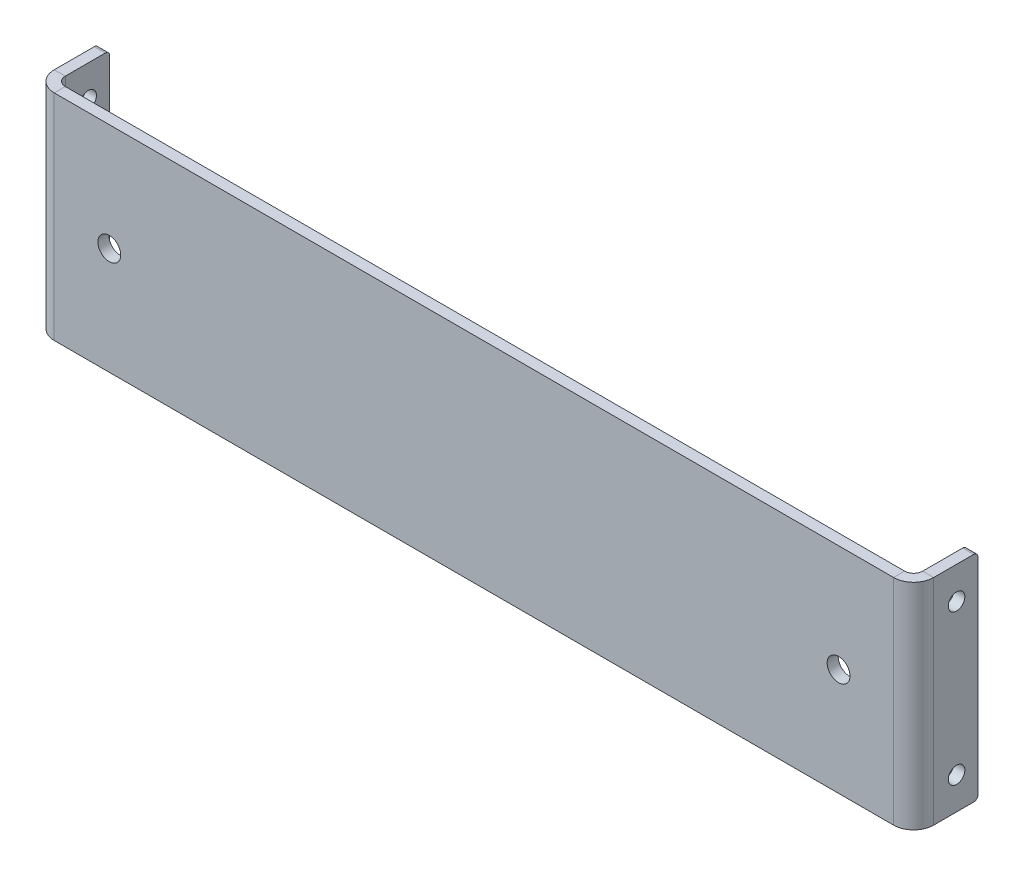
ISO-10303-21;
HEADER;
FILE_DESCRIPTION(('STEP AP214'),'2;1');
FILE_NAME('part.step','',(''),(''),'','','');
FILE_SCHEMA(('AUTOMOTIVE_DESIGN { 1 0 10303 214 1 1 1 1 }'));
ENDSEC;
DATA;
#1=APPLICATION_CONTEXT('core data for automotive mechanical design processes');
#2=APPLICATION_PROTOCOL_DEFINITION('international standard','automotive_design',2000,#1);
#3=PRODUCT_CONTEXT('',#1,'mechanical');
#4=PRODUCT('Part','Part','',(#3));
#5=PRODUCT_RELATED_PRODUCT_CATEGORY('part','',(#4));
#6=PRODUCT_DEFINITION_FORMATION('','',#4);
#7=PRODUCT_DEFINITION_CONTEXT('part definition',#1,'design');
#8=PRODUCT_DEFINITION('design','',#6,#7);
#9=PRODUCT_DEFINITION_SHAPE('','',#8);
#10=(LENGTH_UNIT() NAMED_UNIT(*) SI_UNIT(.MILLI.,.METRE.));
#11=(NAMED_UNIT(*) PLANE_ANGLE_UNIT() SI_UNIT($,.RADIAN.));
#12=(NAMED_UNIT(*) SI_UNIT($,.STERADIAN.) SOLID_ANGLE_UNIT());
#13=UNCERTAINTY_MEASURE_WITH_UNIT(LENGTH_MEASURE(1.E-05),#10,'distance_accuracy_value','');
#14=(GEOMETRIC_REPRESENTATION_CONTEXT(3) GLOBAL_UNCERTAINTY_ASSIGNED_CONTEXT((#13)) GLOBAL_UNIT_ASSIGNED_CONTEXT((#10,
#11,#12)) REPRESENTATION_CONTEXT('',''));
#15=CARTESIAN_POINT('',(0.,0.,0.));
#16=DIRECTION('',(0.,0.,1.));
#17=DIRECTION('',(1.,0.,0.));
#18=AXIS2_PLACEMENT_3D('',#15,#16,#17);
#19=CARTESIAN_POINT('',(0.,0.,-3.2639));
#20=DIRECTION('',(0.,0.,-1.));
#21=DIRECTION('',(-1.,0.,0.));
#22=AXIS2_PLACEMENT_3D('',#19,#20,#21);
#23=PLANE('',#22);
#24=CARTESIAN_POINT('',(-107.95,0.,-3.2639));
#25=DIRECTION('',(0.,0.,-1.));
#26=DIRECTION('',(-1.,0.,0.));
#27=AXIS2_PLACEMENT_3D('',#24,#25,#26);
#28=CIRCLE('',#27,3.3782);
#29=CARTESIAN_POINT('',(-111.3282,0.,-3.2639));
#30=VERTEX_POINT('',#29);
#31=EDGE_CURVE('E446',#30,#30,#28,.T.);
#32=ORIENTED_EDGE('',*,*,#31,.F.);
#33=EDGE_LOOP('',(#32));
#34=FACE_BOUND('',#33,.T.);
#35=CARTESIAN_POINT('',(107.95,0.,-3.2639));
#36=DIRECTION('',(0.,0.,-1.));
#37=DIRECTION('',(-1.,0.,0.));
#38=AXIS2_PLACEMENT_3D('',#35,#36,#37);
#39=CIRCLE('',#38,3.3782);
#40=CARTESIAN_POINT('',(104.5718,0.,-3.2639));
#41=VERTEX_POINT('',#40);
#42=EDGE_CURVE('E440',#41,#41,#39,.T.);
#43=ORIENTED_EDGE('',*,*,#42,.F.);
#44=EDGE_LOOP('',(#43));
#45=FACE_BOUND('',#44,.T.);
#46=DIRECTION('',(1.,0.,0.));
#47=VECTOR('',#46,1.);
#48=CARTESIAN_POINT('',(-130.175,-31.75,-3.2639));
#49=LINE('',#48,#47);
#50=CARTESIAN_POINT('',(-124.25426,-31.75,-3.26390000000002));
#51=VERTEX_POINT('',#50);
#52=CARTESIAN_POINT('',(124.25426,-31.75,-3.2639));
#53=VERTEX_POINT('',#52);
#54=EDGE_CURVE('E314',#51,#53,#49,.T.);
#55=ORIENTED_EDGE('',*,*,#54,.F.);
#56=DIRECTION('',(0.,1.,0.));
#57=VECTOR('',#56,1.);
#58=CARTESIAN_POINT('',(-124.25426,31.75,-3.26390000000002));
#59=LINE('',#58,#57);
#60=CARTESIAN_POINT('',(-124.25426,31.75,-3.26390000000002));
#61=VERTEX_POINT('',#60);
#62=EDGE_CURVE('E252',#61,#51,#59,.F.);
#63=ORIENTED_EDGE('',*,*,#62,.F.);
#64=DIRECTION('',(-1.,0.,0.));
#65=VECTOR('',#64,1.);
#66=CARTESIAN_POINT('',(-130.175,31.75,-3.2639));
#67=LINE('',#66,#65);
#68=CARTESIAN_POINT('',(124.25426,31.75,-3.2639));
#69=VERTEX_POINT('',#68);
#70=EDGE_CURVE('E311',#69,#61,#67,.T.);
#71=ORIENTED_EDGE('',*,*,#70,.F.);
#72=DIRECTION('',(0.,-1.,0.));
#73=VECTOR('',#72,1.);
#74=CARTESIAN_POINT('',(124.25426,-31.75,-3.26390000000002));
#75=LINE('',#74,#73);
#76=EDGE_CURVE('E301',#53,#69,#75,.F.);
#77=ORIENTED_EDGE('',*,*,#76,.F.);
#78=EDGE_LOOP('',(#55,#63,#71,#77));
#79=FACE_BOUND('',#78,.T.);
#80=ADVANCED_FACE('F81',(#34,#45,#79),#23,.T.);
#81=CARTESIAN_POINT('',(0.,0.,0.));
#82=DIRECTION('',(0.,0.,-1.));
#83=DIRECTION('',(-1.,0.,0.));
#84=AXIS2_PLACEMENT_3D('',#81,#82,#83);
#85=PLANE('',#84);
#86=CARTESIAN_POINT('',(-107.95,0.,0.));
#87=DIRECTION('',(0.,0.,1.));
#88=DIRECTION('',(1.,0.,0.));
#89=AXIS2_PLACEMENT_3D('',#86,#87,#88);
#90=CIRCLE('',#89,3.3782);
#91=CARTESIAN_POINT('',(-104.5718,0.,0.));
#92=VERTEX_POINT('',#91);
#93=EDGE_CURVE('E449',#92,#92,#90,.T.);
#94=ORIENTED_EDGE('',*,*,#93,.F.);
#95=EDGE_LOOP('',(#94));
#96=FACE_BOUND('',#95,.T.);
#97=CARTESIAN_POINT('',(107.95,0.,0.));
#98=DIRECTION('',(0.,0.,1.));
#99=DIRECTION('',(1.,0.,0.));
#100=AXIS2_PLACEMENT_3D('',#97,#98,#99);
#101=CIRCLE('',#100,3.3782);
#102=CARTESIAN_POINT('',(111.3282,0.,0.));
#103=VERTEX_POINT('',#102);
#104=EDGE_CURVE('E443',#103,#103,#101,.T.);
#105=ORIENTED_EDGE('',*,*,#104,.F.);
#106=EDGE_LOOP('',(#105));
#107=FACE_BOUND('',#106,.T.);
#108=DIRECTION('',(0.,1.,0.));
#109=VECTOR('',#108,1.);
#110=CARTESIAN_POINT('',(-124.25426,31.75,0.));
#111=LINE('',#110,#109);
#112=CARTESIAN_POINT('',(-124.25426,31.75,0.));
#113=VERTEX_POINT('',#112);
#114=CARTESIAN_POINT('',(-124.25426,-31.75,0.));
#115=VERTEX_POINT('',#114);
#116=EDGE_CURVE('E219',#113,#115,#111,.F.);
#117=ORIENTED_EDGE('',*,*,#116,.T.);
#118=DIRECTION('',(1.,0.,0.));
#119=VECTOR('',#118,1.);
#120=CARTESIAN_POINT('',(-130.175,-31.75,0.));
#121=LINE('',#120,#119);
#122=CARTESIAN_POINT('',(124.25426,-31.75,0.));
#123=VERTEX_POINT('',#122);
#124=EDGE_CURVE('E315',#115,#123,#121,.T.);
#125=ORIENTED_EDGE('',*,*,#124,.T.);
#126=DIRECTION('',(0.,-1.,0.));
#127=VECTOR('',#126,1.);
#128=CARTESIAN_POINT('',(124.25426,-31.75,0.));
#129=LINE('',#128,#127);
#130=CARTESIAN_POINT('',(124.25426,31.75,0.));
#131=VERTEX_POINT('',#130);
#132=EDGE_CURVE('E289',#123,#131,#129,.F.);
#133=ORIENTED_EDGE('',*,*,#132,.T.);
#134=DIRECTION('',(-1.,0.,0.));
#135=VECTOR('',#134,1.);
#136=CARTESIAN_POINT('',(-130.175,31.75,0.));
#137=LINE('',#136,#135);
#138=EDGE_CURVE('E309',#131,#113,#137,.T.);
#139=ORIENTED_EDGE('',*,*,#138,.T.);
#140=EDGE_LOOP('',(#117,#125,#133,#139));
#141=FACE_BOUND('',#140,.T.);
#142=ADVANCED_FACE('F392',(#96,#107,#141),#85,.F.);
#143=CARTESIAN_POINT('',(-130.175,31.75,-3.2639));
#144=DIRECTION('',(0.,1.,0.));
#145=DIRECTION('',(0.,0.,1.));
#146=AXIS2_PLACEMENT_3D('',#143,#144,#145);
#147=PLANE('',#146);
#148=ORIENTED_EDGE('',*,*,#70,.T.);
#149=DIRECTION('',(0.,0.,1.));
#150=VECTOR('',#149,1.);
#151=CARTESIAN_POINT('',(-124.25426,31.75,-3.26390000000002));
#152=LINE('',#151,#150);
#153=EDGE_CURVE('E248',#61,#113,#152,.T.);
#154=ORIENTED_EDGE('',*,*,#153,.T.);
#155=ORIENTED_EDGE('',*,*,#138,.F.);
#156=DIRECTION('',(0.,0.,1.));
#157=VECTOR('',#156,1.);
#158=CARTESIAN_POINT('',(124.25426,31.75,-3.26390000000002));
#159=LINE('',#158,#157);
#160=EDGE_CURVE('E306',#69,#131,#159,.T.);
#161=ORIENTED_EDGE('',*,*,#160,.F.);
#162=EDGE_LOOP('',(#148,#154,#155,#161));
#163=FACE_BOUND('',#162,.T.);
#164=ADVANCED_FACE('F395',(#163),#147,.T.);
#165=CARTESIAN_POINT('',(-130.175,-31.75,-3.2639));
#166=DIRECTION('',(0.,-1.,0.));
#167=DIRECTION('',(0.,0.,-1.));
#168=AXIS2_PLACEMENT_3D('',#165,#166,#167);
#169=PLANE('',#168);
#170=DIRECTION('',(0.,0.,1.));
#171=VECTOR('',#170,1.);
#172=CARTESIAN_POINT('',(-124.25426,-31.75,-3.26390000000002));
#173=LINE('',#172,#171);
#174=EDGE_CURVE('E256',#51,#115,#173,.T.);
#175=ORIENTED_EDGE('',*,*,#174,.F.);
#176=ORIENTED_EDGE('',*,*,#54,.T.);
#177=DIRECTION('',(0.,0.,1.));
#178=VECTOR('',#177,1.);
#179=CARTESIAN_POINT('',(124.25426,-31.75,-3.26390000000002));
#180=LINE('',#179,#178);
#181=EDGE_CURVE('E295',#53,#123,#180,.T.);
#182=ORIENTED_EDGE('',*,*,#181,.T.);
#183=ORIENTED_EDGE('',*,*,#124,.F.);
#184=EDGE_LOOP('',(#175,#176,#182,#183));
#185=FACE_BOUND('',#184,.T.);
#186=ADVANCED_FACE('F390',(#185),#169,.T.);
#187=CARTESIAN_POINT('',(124.25426,31.75,-5.92074000000002));
#188=DIRECTION('',(0.,1.,0.));
#189=DIRECTION('',(0.,0.,1.));
#190=AXIS2_PLACEMENT_3D('',#187,#188,#189);
#191=PLANE('',#190);
#192=DIRECTION('',(1.,0.,0.));
#193=VECTOR('',#192,1.);
#194=CARTESIAN_POINT('',(130.175,31.75,-5.92074));
#195=LINE('',#194,#193);
#196=CARTESIAN_POINT('',(126.9111,31.75,-5.92074000000001));
#197=VERTEX_POINT('',#196);
#198=CARTESIAN_POINT('',(130.175,31.75,-5.92074));
#199=VERTEX_POINT('',#198);
#200=EDGE_CURVE('E259',#197,#199,#195,.T.);
#201=ORIENTED_EDGE('',*,*,#200,.F.);
#202=CARTESIAN_POINT('',(124.25426,31.75,-5.92074000000002));
#203=DIRECTION('',(0.,-1.,0.));
#204=DIRECTION('',(0.,0.,-1.));
#205=AXIS2_PLACEMENT_3D('',#202,#203,#204);
#206=CIRCLE('',#205,2.65683999999999);
#207=EDGE_CURVE('E298',#69,#197,#206,.F.);
#208=ORIENTED_EDGE('',*,*,#207,.F.);
#209=ORIENTED_EDGE('',*,*,#160,.T.);
#210=CARTESIAN_POINT('',(124.25426,31.75,-5.92074000000002));
#211=DIRECTION('',(0.,-1.,0.));
#212=DIRECTION('',(0.,0.,-1.));
#213=AXIS2_PLACEMENT_3D('',#210,#211,#212);
#214=CIRCLE('',#213,5.92073999999999);
#215=EDGE_CURVE('E291',#131,#199,#214,.F.);
#216=ORIENTED_EDGE('',*,*,#215,.T.);
#217=EDGE_LOOP('',(#201,#208,#209,#216));
#218=FACE_BOUND('',#217,.T.);
#219=ADVANCED_FACE('F376',(#218),#191,.T.);
#220=CARTESIAN_POINT('',(124.25426,-31.75,-5.92074000000002));
#221=DIRECTION('',(0.,1.,0.));
#222=DIRECTION('',(0.,0.,1.));
#223=AXIS2_PLACEMENT_3D('',#220,#221,#222);
#224=PLANE('',#223);
#225=CARTESIAN_POINT('',(124.25426,-31.75,-5.92074000000002));
#226=DIRECTION('',(0.,-1.,0.));
#227=DIRECTION('',(0.,0.,-1.));
#228=AXIS2_PLACEMENT_3D('',#225,#226,#227);
#229=CIRCLE('',#228,2.65683999999999);
#230=CARTESIAN_POINT('',(126.9111,-31.75,-5.92074000000001));
#231=VERTEX_POINT('',#230);
#232=EDGE_CURVE('E264',#231,#53,#229,.T.);
#233=ORIENTED_EDGE('',*,*,#232,.F.);
#234=DIRECTION('',(1.,0.,0.));
#235=VECTOR('',#234,1.);
#236=CARTESIAN_POINT('',(126.9111,-31.75,-5.92074000000001));
#237=LINE('',#236,#235);
#238=CARTESIAN_POINT('',(130.175,-31.75,-5.92074));
#239=VERTEX_POINT('',#238);
#240=EDGE_CURVE('E281',#231,#239,#237,.T.);
#241=ORIENTED_EDGE('',*,*,#240,.T.);
#242=CARTESIAN_POINT('',(124.25426,-31.75,-5.92074000000002));
#243=DIRECTION('',(0.,-1.,0.));
#244=DIRECTION('',(0.,0.,-1.));
#245=AXIS2_PLACEMENT_3D('',#242,#243,#244);
#246=CIRCLE('',#245,5.92073999999999);
#247=EDGE_CURVE('E292',#239,#123,#246,.T.);
#248=ORIENTED_EDGE('',*,*,#247,.T.);
#249=ORIENTED_EDGE('',*,*,#181,.F.);
#250=EDGE_LOOP('',(#233,#241,#248,#249));
#251=FACE_BOUND('',#250,.T.);
#252=ADVANCED_FACE('F369',(#251),#224,.F.);
#253=CARTESIAN_POINT('',(124.25426,-31.75,-5.92074000000002));
#254=DIRECTION('',(0.,-1.,0.));
#255=DIRECTION('',(1.,0.,0.));
#256=AXIS2_PLACEMENT_3D('',#253,#254,#255);
#257=CYLINDRICAL_SURFACE('',#256,5.92073999999999);
#258=ORIENTED_EDGE('',*,*,#132,.F.);
#259=ORIENTED_EDGE('',*,*,#247,.F.);
#260=DIRECTION('',(0.,-1.,0.));
#261=VECTOR('',#260,1.);
#262=CARTESIAN_POINT('',(130.175,0.,-5.92074));
#263=LINE('',#262,#261);
#264=EDGE_CURVE('E278',#199,#239,#263,.T.);
#265=ORIENTED_EDGE('',*,*,#264,.F.);
#266=ORIENTED_EDGE('',*,*,#215,.F.);
#267=EDGE_LOOP('',(#258,#259,#265,#266));
#268=FACE_BOUND('',#267,.T.);
#269=ADVANCED_FACE('F374',(#268),#257,.T.);
#270=CARTESIAN_POINT('',(124.25426,-31.75,-5.92074000000002));
#271=DIRECTION('',(0.,-1.,0.));
#272=DIRECTION('',(1.,0.,0.));
#273=AXIS2_PLACEMENT_3D('',#270,#271,#272);
#274=CYLINDRICAL_SURFACE('',#273,2.65683999999999);
#275=ORIENTED_EDGE('',*,*,#76,.T.);
#276=ORIENTED_EDGE('',*,*,#207,.T.);
#277=DIRECTION('',(0.,1.,0.));
#278=VECTOR('',#277,1.);
#279=CARTESIAN_POINT('',(126.9111,31.75,-5.92074000000001));
#280=LINE('',#279,#278);
#281=EDGE_CURVE('E284',#197,#231,#280,.F.);
#282=ORIENTED_EDGE('',*,*,#281,.T.);
#283=ORIENTED_EDGE('',*,*,#232,.T.);
#284=EDGE_LOOP('',(#275,#276,#282,#283));
#285=FACE_BOUND('',#284,.T.);
#286=ADVANCED_FACE('F383',(#285),#274,.F.);
#287=CARTESIAN_POINT('',(130.175,-31.75,-3.26389999999999));
#288=DIRECTION('',(0.,-1.,0.));
#289=DIRECTION('',(0.,0.,-1.));
#290=AXIS2_PLACEMENT_3D('',#287,#288,#289);
#291=PLANE('',#290);
#292=DIRECTION('',(0.,0.,-1.));
#293=VECTOR('',#292,1.);
#294=CARTESIAN_POINT('',(126.9111,-31.75,4.57754867353493E-13));
#295=LINE('',#294,#293);
#296=CARTESIAN_POINT('',(126.9111,-31.75,-17.78));
#297=VERTEX_POINT('',#296);
#298=EDGE_CURVE('E270',#297,#231,#295,.F.);
#299=ORIENTED_EDGE('',*,*,#298,.F.);
#300=DIRECTION('',(-1.,0.,0.));
#301=VECTOR('',#300,1.);
#302=CARTESIAN_POINT('',(130.175,-31.75,-17.78));
#303=LINE('',#302,#301);
#304=CARTESIAN_POINT('',(130.175,-31.75,-17.78));
#305=VERTEX_POINT('',#304);
#306=EDGE_CURVE('E104',#297,#305,#303,.F.);
#307=ORIENTED_EDGE('',*,*,#306,.T.);
#308=DIRECTION('',(0.,0.,1.));
#309=VECTOR('',#308,1.);
#310=CARTESIAN_POINT('',(130.175,-31.75,-3.26389999999999));
#311=LINE('',#310,#309);
#312=EDGE_CURVE('E262',#305,#239,#311,.T.);
#313=ORIENTED_EDGE('',*,*,#312,.T.);
#314=ORIENTED_EDGE('',*,*,#240,.F.);
#315=EDGE_LOOP('',(#299,#307,#313,#314));
#316=FACE_BOUND('',#315,.T.);
#317=ADVANCED_FACE('F365',(#316),#291,.T.);
#318=CARTESIAN_POINT('',(130.175,31.75,-19.05));
#319=DIRECTION('',(0.,1.,0.));
#320=DIRECTION('',(0.,0.,1.));
#321=AXIS2_PLACEMENT_3D('',#318,#319,#320);
#322=PLANE('',#321);
#323=DIRECTION('',(0.,0.,-1.));
#324=VECTOR('',#323,1.);
#325=CARTESIAN_POINT('',(130.175,31.75,-19.05));
#326=LINE('',#325,#324);
#327=CARTESIAN_POINT('',(130.175,31.75,-17.78));
#328=VERTEX_POINT('',#327);
#329=EDGE_CURVE('E268',#199,#328,#326,.T.);
#330=ORIENTED_EDGE('',*,*,#329,.T.);
#331=DIRECTION('',(-1.,0.,0.));
#332=VECTOR('',#331,1.);
#333=CARTESIAN_POINT('',(130.175,31.75,-17.78));
#334=LINE('',#333,#332);
#335=CARTESIAN_POINT('',(126.9111,31.75,-17.78));
#336=VERTEX_POINT('',#335);
#337=EDGE_CURVE('E13',#328,#336,#334,.T.);
#338=ORIENTED_EDGE('',*,*,#337,.T.);
#339=DIRECTION('',(0.,0.,1.));
#340=VECTOR('',#339,1.);
#341=CARTESIAN_POINT('',(126.9111,31.75,4.43798926275643E-13));
#342=LINE('',#341,#340);
#343=EDGE_CURVE('E275',#197,#336,#342,.F.);
#344=ORIENTED_EDGE('',*,*,#343,.F.);
#345=ORIENTED_EDGE('',*,*,#200,.T.);
#346=EDGE_LOOP('',(#330,#338,#344,#345));
#347=FACE_BOUND('',#346,.T.);
#348=ADVANCED_FACE('F380',(#347),#322,.T.);
#349=CARTESIAN_POINT('',(130.175,0.,4.69150713295343E-13));
#350=DIRECTION('',(1.,0.,0.));
#351=DIRECTION('',(0.,0.,-1.));
#352=AXIS2_PLACEMENT_3D('',#349,#350,#351);
#353=PLANE('',#352);
#354=CARTESIAN_POINT('',(130.175,22.225,-12.7));
#355=DIRECTION('',(1.,0.,0.));
#356=DIRECTION('',(0.,0.,-1.));
#357=AXIS2_PLACEMENT_3D('',#354,#355,#356);
#358=CIRCLE('',#357,2.45745);
#359=CARTESIAN_POINT('',(130.175,22.225,-15.15745));
#360=VERTEX_POINT('',#359);
#361=EDGE_CURVE('E437',#360,#360,#358,.T.);
#362=ORIENTED_EDGE('',*,*,#361,.F.);
#363=EDGE_LOOP('',(#362));
#364=FACE_BOUND('',#363,.T.);
#365=CARTESIAN_POINT('',(130.175,-22.225,-12.7));
#366=DIRECTION('',(1.,0.,0.));
#367=DIRECTION('',(0.,0.,-1.));
#368=AXIS2_PLACEMENT_3D('',#365,#366,#367);
#369=CIRCLE('',#368,2.45745);
#370=CARTESIAN_POINT('',(130.175,-22.225,-15.15745));
#371=VERTEX_POINT('',#370);
#372=EDGE_CURVE('E430',#371,#371,#369,.T.);
#373=ORIENTED_EDGE('',*,*,#372,.F.);
#374=EDGE_LOOP('',(#373));
#375=FACE_BOUND('',#374,.T.);
#376=ORIENTED_EDGE('',*,*,#312,.F.);
#377=CARTESIAN_POINT('',(130.175,-30.48,-17.78));
#378=DIRECTION('',(1.,0.,0.));
#379=DIRECTION('',(0.,0.,-1.));
#380=AXIS2_PLACEMENT_3D('',#377,#378,#379);
#381=CIRCLE('',#380,1.27);
#382=CARTESIAN_POINT('',(130.175,-30.48,-19.05));
#383=VERTEX_POINT('',#382);
#384=EDGE_CURVE('E89',#305,#383,#381,.T.);
#385=ORIENTED_EDGE('',*,*,#384,.T.);
#386=DIRECTION('',(0.,-1.,0.));
#387=VECTOR('',#386,1.);
#388=CARTESIAN_POINT('',(130.175,-31.75,-19.05));
#389=LINE('',#388,#387);
#390=CARTESIAN_POINT('',(130.175,30.48,-19.05));
#391=VERTEX_POINT('',#390);
#392=EDGE_CURVE('E265',#391,#383,#389,.T.);
#393=ORIENTED_EDGE('',*,*,#392,.F.);
#394=CARTESIAN_POINT('',(130.175,30.48,-17.78));
#395=DIRECTION('',(1.,0.,0.));
#396=DIRECTION('',(0.,0.,-1.));
#397=AXIS2_PLACEMENT_3D('',#394,#395,#396);
#398=CIRCLE('',#397,1.27);
#399=EDGE_CURVE('E96',#391,#328,#398,.T.);
#400=ORIENTED_EDGE('',*,*,#399,.T.);
#401=ORIENTED_EDGE('',*,*,#329,.F.);
#402=ORIENTED_EDGE('',*,*,#264,.T.);
#403=EDGE_LOOP('',(#376,#385,#393,#400,#401,#402));
#404=FACE_BOUND('',#403,.T.);
#405=ADVANCED_FACE('F353',(#364,#375,#404),#353,.T.);
#406=CARTESIAN_POINT('',(126.9111,0.,4.57754867353493E-13));
#407=DIRECTION('',(1.,0.,0.));
#408=DIRECTION('',(0.,0.,-1.));
#409=AXIS2_PLACEMENT_3D('',#406,#407,#408);
#410=PLANE('',#409);
#411=CARTESIAN_POINT('',(126.9111,22.225,-12.7));
#412=DIRECTION('',(1.,0.,0.));
#413=DIRECTION('',(0.,0.,-1.));
#414=AXIS2_PLACEMENT_3D('',#411,#412,#413);
#415=CIRCLE('',#414,2.45744999999998);
#416=CARTESIAN_POINT('',(126.9111,22.225,-15.15745));
#417=VERTEX_POINT('',#416);
#418=EDGE_CURVE('E324',#417,#417,#415,.T.);
#419=ORIENTED_EDGE('',*,*,#418,.T.);
#420=EDGE_LOOP('',(#419));
#421=FACE_BOUND('',#420,.T.);
#422=CARTESIAN_POINT('',(126.9111,-22.225,-12.7));
#423=DIRECTION('',(1.,0.,0.));
#424=DIRECTION('',(0.,0.,-1.));
#425=AXIS2_PLACEMENT_3D('',#422,#423,#424);
#426=CIRCLE('',#425,2.45744999999998);
#427=CARTESIAN_POINT('',(126.9111,-22.225,-15.15745));
#428=VERTEX_POINT('',#427);
#429=EDGE_CURVE('E245',#428,#428,#426,.T.);
#430=ORIENTED_EDGE('',*,*,#429,.T.);
#431=EDGE_LOOP('',(#430));
#432=FACE_BOUND('',#431,.T.);
#433=DIRECTION('',(0.,1.,0.));
#434=VECTOR('',#433,1.);
#435=CARTESIAN_POINT('',(126.9111,0.,-19.05));
#436=LINE('',#435,#434);
#437=CARTESIAN_POINT('',(126.9111,30.48,-19.05));
#438=VERTEX_POINT('',#437);
#439=CARTESIAN_POINT('',(126.9111,-30.48,-19.05));
#440=VERTEX_POINT('',#439);
#441=EDGE_CURVE('E272',#438,#440,#436,.F.);
#442=ORIENTED_EDGE('',*,*,#441,.T.);
#443=CARTESIAN_POINT('',(126.9111,-30.48,-17.78));
#444=DIRECTION('',(1.,0.,0.));
#445=DIRECTION('',(0.,0.,-1.));
#446=AXIS2_PLACEMENT_3D('',#443,#444,#445);
#447=CIRCLE('',#446,1.27);
#448=EDGE_CURVE('E349',#440,#297,#447,.F.);
#449=ORIENTED_EDGE('',*,*,#448,.T.);
#450=ORIENTED_EDGE('',*,*,#298,.T.);
#451=ORIENTED_EDGE('',*,*,#281,.F.);
#452=ORIENTED_EDGE('',*,*,#343,.T.);
#453=CARTESIAN_POINT('',(126.9111,30.48,-17.78));
#454=DIRECTION('',(1.,0.,0.));
#455=DIRECTION('',(0.,0.,-1.));
#456=AXIS2_PLACEMENT_3D('',#453,#454,#455);
#457=CIRCLE('',#456,1.27);
#458=EDGE_CURVE('E347',#336,#438,#457,.F.);
#459=ORIENTED_EDGE('',*,*,#458,.T.);
#460=EDGE_LOOP('',(#442,#449,#450,#451,#452,#459));
#461=FACE_BOUND('',#460,.T.);
#462=ADVANCED_FACE('F362',(#421,#432,#461),#410,.F.);
#463=CARTESIAN_POINT('',(130.175,-31.75,-19.05));
#464=DIRECTION('',(0.,0.,-1.));
#465=DIRECTION('',(-1.,0.,0.));
#466=AXIS2_PLACEMENT_3D('',#463,#464,#465);
#467=PLANE('',#466);
#468=ORIENTED_EDGE('',*,*,#392,.T.);
#469=DIRECTION('',(-1.,0.,0.));
#470=VECTOR('',#469,1.);
#471=CARTESIAN_POINT('',(130.175,-30.48,-19.05));
#472=LINE('',#471,#470);
#473=EDGE_CURVE('E344',#383,#440,#472,.T.);
#474=ORIENTED_EDGE('',*,*,#473,.T.);
#475=ORIENTED_EDGE('',*,*,#441,.F.);
#476=DIRECTION('',(-1.,0.,0.));
#477=VECTOR('',#476,1.);
#478=CARTESIAN_POINT('',(130.175,30.48,-19.05));
#479=LINE('',#478,#477);
#480=EDGE_CURVE('E342',#438,#391,#479,.F.);
#481=ORIENTED_EDGE('',*,*,#480,.T.);
#482=EDGE_LOOP('',(#468,#474,#475,#481));
#483=FACE_BOUND('',#482,.T.);
#484=ADVANCED_FACE('F357',(#483),#467,.T.);
#485=CARTESIAN_POINT('',(-124.25426,-31.75,-5.92074000000002));
#486=DIRECTION('',(0.,-1.,0.));
#487=DIRECTION('',(0.,0.,-1.));
#488=AXIS2_PLACEMENT_3D('',#485,#486,#487);
#489=PLANE('',#488);
#490=DIRECTION('',(-1.,0.,0.));
#491=VECTOR('',#490,1.);
#492=CARTESIAN_POINT('',(-130.175,-31.75,-5.92074));
#493=LINE('',#492,#491);
#494=CARTESIAN_POINT('',(-126.9111,-31.75,-5.92074000000001));
#495=VERTEX_POINT('',#494);
#496=CARTESIAN_POINT('',(-130.175,-31.75,-5.92074));
#497=VERTEX_POINT('',#496);
#498=EDGE_CURVE('E242',#495,#497,#493,.T.);
#499=ORIENTED_EDGE('',*,*,#498,.F.);
#500=CARTESIAN_POINT('',(-124.25426,-31.75,-5.92074000000002));
#501=DIRECTION('',(0.,1.,0.));
#502=DIRECTION('',(0.,0.,1.));
#503=AXIS2_PLACEMENT_3D('',#500,#501,#502);
#504=CIRCLE('',#503,2.65683999999999);
#505=EDGE_CURVE('E222',#51,#495,#504,.F.);
#506=ORIENTED_EDGE('',*,*,#505,.F.);
#507=ORIENTED_EDGE('',*,*,#174,.T.);
#508=CARTESIAN_POINT('',(-124.25426,-31.75,-5.92074000000002));
#509=DIRECTION('',(0.,1.,0.));
#510=DIRECTION('',(0.,0.,1.));
#511=AXIS2_PLACEMENT_3D('',#508,#509,#510);
#512=CIRCLE('',#511,5.92073999999999);
#513=EDGE_CURVE('E247',#115,#497,#512,.F.);
#514=ORIENTED_EDGE('',*,*,#513,.T.);
#515=EDGE_LOOP('',(#499,#506,#507,#514));
#516=FACE_BOUND('',#515,.T.);
#517=ADVANCED_FACE('F560',(#516),#489,.T.);
#518=CARTESIAN_POINT('',(-124.25426,31.75,-5.92074000000002));
#519=DIRECTION('',(0.,-1.,0.));
#520=DIRECTION('',(0.,0.,-1.));
#521=AXIS2_PLACEMENT_3D('',#518,#519,#520);
#522=PLANE('',#521);
#523=CARTESIAN_POINT('',(-124.25426,31.75,-5.92074000000002));
#524=DIRECTION('',(0.,1.,0.));
#525=DIRECTION('',(0.,0.,1.));
#526=AXIS2_PLACEMENT_3D('',#523,#524,#525);
#527=CIRCLE('',#526,2.65683999999999);
#528=CARTESIAN_POINT('',(-126.9111,31.75,-5.92074000000001));
#529=VERTEX_POINT('',#528);
#530=EDGE_CURVE('E208',#529,#61,#527,.T.);
#531=ORIENTED_EDGE('',*,*,#530,.F.);
#532=DIRECTION('',(-1.,0.,0.));
#533=VECTOR('',#532,1.);
#534=CARTESIAN_POINT('',(-126.9111,31.75,-5.92074000000001));
#535=LINE('',#534,#533);
#536=CARTESIAN_POINT('',(-130.175,31.75,-5.92074));
#537=VERTEX_POINT('',#536);
#538=EDGE_CURVE('E202',#529,#537,#535,.T.);
#539=ORIENTED_EDGE('',*,*,#538,.T.);
#540=CARTESIAN_POINT('',(-124.25426,31.75,-5.92074000000002));
#541=DIRECTION('',(0.,1.,0.));
#542=DIRECTION('',(0.,0.,1.));
#543=AXIS2_PLACEMENT_3D('',#540,#541,#542);
#544=CIRCLE('',#543,5.92073999999999);
#545=EDGE_CURVE('E214',#537,#113,#544,.T.);
#546=ORIENTED_EDGE('',*,*,#545,.T.);
#547=ORIENTED_EDGE('',*,*,#153,.F.);
#548=EDGE_LOOP('',(#531,#539,#546,#547));
#549=FACE_BOUND('',#548,.T.);
#550=ADVANCED_FACE('F225',(#549),#522,.F.);
#551=CARTESIAN_POINT('',(-124.25426,31.75,-5.92074000000002));
#552=DIRECTION('',(0.,1.,0.));
#553=DIRECTION('',(-1.,0.,0.));
#554=AXIS2_PLACEMENT_3D('',#551,#552,#553);
#555=CYLINDRICAL_SURFACE('',#554,5.92073999999999);
#556=ORIENTED_EDGE('',*,*,#116,.F.);
#557=ORIENTED_EDGE('',*,*,#545,.F.);
#558=DIRECTION('',(0.,1.,0.));
#559=VECTOR('',#558,1.);
#560=CARTESIAN_POINT('',(-130.175,-31.75,-5.92074));
#561=LINE('',#560,#559);
#562=EDGE_CURVE('E217',#537,#497,#561,.F.);
#563=ORIENTED_EDGE('',*,*,#562,.T.);
#564=ORIENTED_EDGE('',*,*,#513,.F.);
#565=EDGE_LOOP('',(#556,#557,#563,#564));
#566=FACE_BOUND('',#565,.T.);
#567=ADVANCED_FACE('F215',(#566),#555,.T.);
#568=CARTESIAN_POINT('',(-124.25426,31.75,-5.92074000000002));
#569=DIRECTION('',(0.,1.,0.));
#570=DIRECTION('',(-1.,0.,0.));
#571=AXIS2_PLACEMENT_3D('',#568,#569,#570);
#572=CYLINDRICAL_SURFACE('',#571,2.65683999999999);
#573=ORIENTED_EDGE('',*,*,#62,.T.);
#574=ORIENTED_EDGE('',*,*,#505,.T.);
#575=DIRECTION('',(0.,1.,0.));
#576=VECTOR('',#575,1.);
#577=CARTESIAN_POINT('',(-126.9111,-31.75,-5.92074000000001));
#578=LINE('',#577,#576);
#579=EDGE_CURVE('E227',#495,#529,#578,.T.);
#580=ORIENTED_EDGE('',*,*,#579,.T.);
#581=ORIENTED_EDGE('',*,*,#530,.T.);
#582=EDGE_LOOP('',(#573,#574,#580,#581));
#583=FACE_BOUND('',#582,.T.);
#584=ADVANCED_FACE('F397',(#583),#572,.F.);
#585=CARTESIAN_POINT('',(-130.175,-31.75,-3.26389999999999));
#586=DIRECTION('',(0.,-1.,0.));
#587=DIRECTION('',(0.,0.,-1.));
#588=AXIS2_PLACEMENT_3D('',#585,#586,#587);
#589=PLANE('',#588);
#590=DIRECTION('',(0.,0.,1.));
#591=VECTOR('',#590,1.);
#592=CARTESIAN_POINT('',(-130.175,-31.75,-3.26389999999999));
#593=LINE('',#592,#591);
#594=CARTESIAN_POINT('',(-130.175,-31.75,-17.78));
#595=VERTEX_POINT('',#594);
#596=EDGE_CURVE('E232',#497,#595,#593,.F.);
#597=ORIENTED_EDGE('',*,*,#596,.T.);
#598=DIRECTION('',(1.,0.,0.));
#599=VECTOR('',#598,1.);
#600=CARTESIAN_POINT('',(-130.175,-31.75,-17.78));
#601=LINE('',#600,#599);
#602=CARTESIAN_POINT('',(-126.9111,-31.75,-17.78));
#603=VERTEX_POINT('',#602);
#604=EDGE_CURVE('E339',#595,#603,#601,.T.);
#605=ORIENTED_EDGE('',*,*,#604,.T.);
#606=DIRECTION('',(0.,0.,-1.));
#607=VECTOR('',#606,1.);
#608=CARTESIAN_POINT('',(-126.9111,-31.75,4.57754867353493E-13));
#609=LINE('',#608,#607);
#610=EDGE_CURVE('E233',#495,#603,#609,.T.);
#611=ORIENTED_EDGE('',*,*,#610,.F.);
#612=ORIENTED_EDGE('',*,*,#498,.T.);
#613=EDGE_LOOP('',(#597,#605,#611,#612));
#614=FACE_BOUND('',#613,.T.);
#615=ADVANCED_FACE('F406',(#614),#589,.T.);
#616=CARTESIAN_POINT('',(-130.175,31.75,-19.05));
#617=DIRECTION('',(0.,1.,0.));
#618=DIRECTION('',(0.,0.,1.));
#619=AXIS2_PLACEMENT_3D('',#616,#617,#618);
#620=PLANE('',#619);
#621=DIRECTION('',(0.,0.,1.));
#622=VECTOR('',#621,1.);
#623=CARTESIAN_POINT('',(-126.9111,31.75,4.43798926275643E-13));
#624=LINE('',#623,#622);
#625=CARTESIAN_POINT('',(-126.9111,31.75,-17.78));
#626=VERTEX_POINT('',#625);
#627=EDGE_CURVE('E404',#626,#529,#624,.T.);
#628=ORIENTED_EDGE('',*,*,#627,.F.);
#629=DIRECTION('',(1.,0.,0.));
#630=VECTOR('',#629,1.);
#631=CARTESIAN_POINT('',(-130.175,31.75,-17.78));
#632=LINE('',#631,#630);
#633=CARTESIAN_POINT('',(-130.175,31.75,-17.78));
#634=VERTEX_POINT('',#633);
#635=EDGE_CURVE('E204',#626,#634,#632,.F.);
#636=ORIENTED_EDGE('',*,*,#635,.T.);
#637=DIRECTION('',(0.,0.,-1.));
#638=VECTOR('',#637,1.);
#639=CARTESIAN_POINT('',(-130.175,31.75,-19.05));
#640=LINE('',#639,#638);
#641=EDGE_CURVE('E197',#634,#537,#640,.F.);
#642=ORIENTED_EDGE('',*,*,#641,.T.);
#643=ORIENTED_EDGE('',*,*,#538,.F.);
#644=EDGE_LOOP('',(#628,#636,#642,#643));
#645=FACE_BOUND('',#644,.T.);
#646=ADVANCED_FACE('F200',(#645),#620,.T.);
#647=CARTESIAN_POINT('',(-130.175,0.,4.69150713295344E-13));
#648=DIRECTION('',(1.,0.,0.));
#649=DIRECTION('',(0.,0.,-1.));
#650=AXIS2_PLACEMENT_3D('',#647,#648,#649);
#651=PLANE('',#650);
#652=CARTESIAN_POINT('',(-130.175,22.225,-12.7000000000009));
#653=DIRECTION('',(1.,0.,0.));
#654=DIRECTION('',(0.,0.,-1.));
#655=AXIS2_PLACEMENT_3D('',#652,#653,#654);
#656=CIRCLE('',#655,2.45744999999997);
#657=CARTESIAN_POINT('',(-130.175,22.225,-15.1574500000009));
#658=VERTEX_POINT('',#657);
#659=EDGE_CURVE('E325',#658,#658,#656,.T.);
#660=ORIENTED_EDGE('',*,*,#659,.T.);
#661=EDGE_LOOP('',(#660));
#662=FACE_BOUND('',#661,.T.);
#663=CARTESIAN_POINT('',(-130.175,-22.225,-12.7000000000009));
#664=DIRECTION('',(1.,0.,0.));
#665=DIRECTION('',(0.,0.,-1.));
#666=AXIS2_PLACEMENT_3D('',#663,#664,#665);
#667=CIRCLE('',#666,2.45744999999997);
#668=CARTESIAN_POINT('',(-130.175,-22.225,-15.1574500000009));
#669=VERTEX_POINT('',#668);
#670=EDGE_CURVE('E427',#669,#669,#667,.T.);
#671=ORIENTED_EDGE('',*,*,#670,.T.);
#672=EDGE_LOOP('',(#671));
#673=FACE_BOUND('',#672,.T.);
#674=ORIENTED_EDGE('',*,*,#641,.F.);
#675=CARTESIAN_POINT('',(-130.175,30.48,-17.78));
#676=DIRECTION('',(1.,0.,0.));
#677=DIRECTION('',(0.,0.,-1.));
#678=AXIS2_PLACEMENT_3D('',#675,#676,#677);
#679=CIRCLE('',#678,1.27);
#680=CARTESIAN_POINT('',(-130.175,30.48,-19.05));
#681=VERTEX_POINT('',#680);
#682=EDGE_CURVE('E337',#634,#681,#679,.F.);
#683=ORIENTED_EDGE('',*,*,#682,.T.);
#684=DIRECTION('',(0.,-1.,0.));
#685=VECTOR('',#684,1.);
#686=CARTESIAN_POINT('',(-130.175,-31.75,-19.05));
#687=LINE('',#686,#685);
#688=CARTESIAN_POINT('',(-130.175,-30.48,-19.05));
#689=VERTEX_POINT('',#688);
#690=EDGE_CURVE('E209',#689,#681,#687,.F.);
#691=ORIENTED_EDGE('',*,*,#690,.F.);
#692=CARTESIAN_POINT('',(-130.175,-30.48,-17.78));
#693=DIRECTION('',(1.,0.,0.));
#694=DIRECTION('',(0.,0.,-1.));
#695=AXIS2_PLACEMENT_3D('',#692,#693,#694);
#696=CIRCLE('',#695,1.27);
#697=EDGE_CURVE('E335',#689,#595,#696,.F.);
#698=ORIENTED_EDGE('',*,*,#697,.T.);
#699=ORIENTED_EDGE('',*,*,#596,.F.);
#700=ORIENTED_EDGE('',*,*,#562,.F.);
#701=EDGE_LOOP('',(#674,#683,#691,#698,#699,#700));
#702=FACE_BOUND('',#701,.T.);
#703=ADVANCED_FACE('F230',(#662,#673,#702),#651,.F.);
#704=CARTESIAN_POINT('',(-126.9111,0.,4.57754867353493E-13));
#705=DIRECTION('',(1.,0.,0.));
#706=DIRECTION('',(0.,0.,-1.));
#707=AXIS2_PLACEMENT_3D('',#704,#705,#706);
#708=PLANE('',#707);
#709=CARTESIAN_POINT('',(-126.9111,22.225,-12.7000000000009));
#710=DIRECTION('',(1.,0.,0.));
#711=DIRECTION('',(0.,0.,-1.));
#712=AXIS2_PLACEMENT_3D('',#709,#710,#711);
#713=CIRCLE('',#712,2.45744999999998);
#714=CARTESIAN_POINT('',(-126.9111,22.225,-15.1574500000009));
#715=VERTEX_POINT('',#714);
#716=EDGE_CURVE('E321',#715,#715,#713,.T.);
#717=ORIENTED_EDGE('',*,*,#716,.F.);
#718=EDGE_LOOP('',(#717));
#719=FACE_BOUND('',#718,.T.);
#720=CARTESIAN_POINT('',(-126.9111,-22.225,-12.7000000000009));
#721=DIRECTION('',(1.,0.,0.));
#722=DIRECTION('',(0.,0.,-1.));
#723=AXIS2_PLACEMENT_3D('',#720,#721,#722);
#724=CIRCLE('',#723,2.45744999999998);
#725=CARTESIAN_POINT('',(-126.9111,-22.225,-15.1574500000009));
#726=VERTEX_POINT('',#725);
#727=EDGE_CURVE('E424',#726,#726,#724,.T.);
#728=ORIENTED_EDGE('',*,*,#727,.F.);
#729=EDGE_LOOP('',(#728));
#730=FACE_BOUND('',#729,.T.);
#731=DIRECTION('',(0.,1.,0.));
#732=VECTOR('',#731,1.);
#733=CARTESIAN_POINT('',(-126.9111,0.,-19.05));
#734=LINE('',#733,#732);
#735=CARTESIAN_POINT('',(-126.9111,-30.48,-19.05));
#736=VERTEX_POINT('',#735);
#737=CARTESIAN_POINT('',(-126.9111,30.48,-19.05));
#738=VERTEX_POINT('',#737);
#739=EDGE_CURVE('E236',#736,#738,#734,.T.);
#740=ORIENTED_EDGE('',*,*,#739,.T.);
#741=CARTESIAN_POINT('',(-126.9111,30.48,-17.78));
#742=DIRECTION('',(1.,0.,0.));
#743=DIRECTION('',(0.,0.,-1.));
#744=AXIS2_PLACEMENT_3D('',#741,#742,#743);
#745=CIRCLE('',#744,1.27);
#746=EDGE_CURVE('E332',#738,#626,#745,.T.);
#747=ORIENTED_EDGE('',*,*,#746,.T.);
#748=ORIENTED_EDGE('',*,*,#627,.T.);
#749=ORIENTED_EDGE('',*,*,#579,.F.);
#750=ORIENTED_EDGE('',*,*,#610,.T.);
#751=CARTESIAN_POINT('',(-126.9111,-30.48,-17.78));
#752=DIRECTION('',(1.,0.,0.));
#753=DIRECTION('',(0.,0.,-1.));
#754=AXIS2_PLACEMENT_3D('',#751,#752,#753);
#755=CIRCLE('',#754,1.27);
#756=EDGE_CURVE('E330',#603,#736,#755,.T.);
#757=ORIENTED_EDGE('',*,*,#756,.T.);
#758=EDGE_LOOP('',(#740,#747,#748,#749,#750,#757));
#759=FACE_BOUND('',#758,.T.);
#760=ADVANCED_FACE('F403',(#719,#730,#759),#708,.T.);
#761=CARTESIAN_POINT('',(-130.175,-31.75,-19.05));
#762=DIRECTION('',(0.,0.,-1.));
#763=DIRECTION('',(-1.,0.,0.));
#764=AXIS2_PLACEMENT_3D('',#761,#762,#763);
#765=PLANE('',#764);
#766=ORIENTED_EDGE('',*,*,#690,.T.);
#767=DIRECTION('',(1.,0.,0.));
#768=VECTOR('',#767,1.);
#769=CARTESIAN_POINT('',(-130.175,30.48,-19.05));
#770=LINE('',#769,#768);
#771=EDGE_CURVE('E327',#681,#738,#770,.T.);
#772=ORIENTED_EDGE('',*,*,#771,.T.);
#773=ORIENTED_EDGE('',*,*,#739,.F.);
#774=DIRECTION('',(1.,0.,0.));
#775=VECTOR('',#774,1.);
#776=CARTESIAN_POINT('',(-130.175,-30.48,-19.05));
#777=LINE('',#776,#775);
#778=EDGE_CURVE('E317',#736,#689,#777,.F.);
#779=ORIENTED_EDGE('',*,*,#778,.T.);
#780=EDGE_LOOP('',(#766,#772,#773,#779));
#781=FACE_BOUND('',#780,.T.);
#782=ADVANCED_FACE('F415',(#781),#765,.T.);
#783=CARTESIAN_POINT('',(130.175,-22.225,-12.7));
#784=DIRECTION('',(1.,0.,0.));
#785=DIRECTION('',(0.,0.,-1.));
#786=AXIS2_PLACEMENT_3D('',#783,#784,#785);
#787=CYLINDRICAL_SURFACE('',#786,2.45744999999998);
#788=ORIENTED_EDGE('',*,*,#727,.T.);
#789=EDGE_LOOP('',(#788));
#790=FACE_BOUND('',#789,.T.);
#791=ORIENTED_EDGE('',*,*,#670,.F.);
#792=EDGE_LOOP('',(#791));
#793=FACE_BOUND('',#792,.T.);
#794=ADVANCED_FACE('F520',(#790,#793),#787,.F.);
#795=ORIENTED_EDGE('',*,*,#372,.T.);
#796=EDGE_LOOP('',(#795));
#797=FACE_BOUND('',#796,.T.);
#798=ORIENTED_EDGE('',*,*,#429,.F.);
#799=EDGE_LOOP('',(#798));
#800=FACE_BOUND('',#799,.T.);
#801=ADVANCED_FACE('F606',(#797,#800),#787,.F.);
#802=CARTESIAN_POINT('',(130.175,22.225,-12.7));
#803=DIRECTION('',(1.,0.,0.));
#804=DIRECTION('',(0.,0.,-1.));
#805=AXIS2_PLACEMENT_3D('',#802,#803,#804);
#806=CYLINDRICAL_SURFACE('',#805,2.45744999999998);
#807=ORIENTED_EDGE('',*,*,#716,.T.);
#808=EDGE_LOOP('',(#807));
#809=FACE_BOUND('',#808,.T.);
#810=ORIENTED_EDGE('',*,*,#659,.F.);
#811=EDGE_LOOP('',(#810));
#812=FACE_BOUND('',#811,.T.);
#813=ADVANCED_FACE('F599',(#809,#812),#806,.F.);
#814=ORIENTED_EDGE('',*,*,#361,.T.);
#815=EDGE_LOOP('',(#814));
#816=FACE_BOUND('',#815,.T.);
#817=ORIENTED_EDGE('',*,*,#418,.F.);
#818=EDGE_LOOP('',(#817));
#819=FACE_BOUND('',#818,.T.);
#820=ADVANCED_FACE('F489',(#816,#819),#806,.F.);
#821=CARTESIAN_POINT('',(-130.175,30.48,-17.78));
#822=DIRECTION('',(1.,0.,0.));
#823=DIRECTION('',(0.,0.,-1.));
#824=AXIS2_PLACEMENT_3D('',#821,#822,#823);
#825=CYLINDRICAL_SURFACE('',#824,1.27);
#826=ORIENTED_EDGE('',*,*,#682,.F.);
#827=ORIENTED_EDGE('',*,*,#635,.F.);
#828=ORIENTED_EDGE('',*,*,#746,.F.);
#829=ORIENTED_EDGE('',*,*,#771,.F.);
#830=EDGE_LOOP('',(#826,#827,#828,#829));
#831=FACE_BOUND('',#830,.T.);
#832=ADVANCED_FACE('F486',(#831),#825,.T.);
#833=CARTESIAN_POINT('',(-130.175,-30.48,-17.78));
#834=DIRECTION('',(1.,0.,0.));
#835=DIRECTION('',(0.,0.,-1.));
#836=AXIS2_PLACEMENT_3D('',#833,#834,#835);
#837=CYLINDRICAL_SURFACE('',#836,1.27);
#838=ORIENTED_EDGE('',*,*,#697,.F.);
#839=ORIENTED_EDGE('',*,*,#778,.F.);
#840=ORIENTED_EDGE('',*,*,#756,.F.);
#841=ORIENTED_EDGE('',*,*,#604,.F.);
#842=EDGE_LOOP('',(#838,#839,#840,#841));
#843=FACE_BOUND('',#842,.T.);
#844=ADVANCED_FACE('F410',(#843),#837,.T.);
#845=CARTESIAN_POINT('',(130.175,-30.48,-17.78));
#846=DIRECTION('',(-1.,0.,0.));
#847=DIRECTION('',(0.,0.,1.));
#848=AXIS2_PLACEMENT_3D('',#845,#846,#847);
#849=CYLINDRICAL_SURFACE('',#848,1.27);
#850=ORIENTED_EDGE('',*,*,#384,.F.);
#851=ORIENTED_EDGE('',*,*,#306,.F.);
#852=ORIENTED_EDGE('',*,*,#448,.F.);
#853=ORIENTED_EDGE('',*,*,#473,.F.);
#854=EDGE_LOOP('',(#850,#851,#852,#853));
#855=FACE_BOUND('',#854,.T.);
#856=ADVANCED_FACE('F360',(#855),#849,.T.);
#857=CARTESIAN_POINT('',(130.175,30.48,-17.78));
#858=DIRECTION('',(-1.,0.,0.));
#859=DIRECTION('',(0.,0.,1.));
#860=AXIS2_PLACEMENT_3D('',#857,#858,#859);
#861=CYLINDRICAL_SURFACE('',#860,1.27);
#862=ORIENTED_EDGE('',*,*,#399,.F.);
#863=ORIENTED_EDGE('',*,*,#480,.F.);
#864=ORIENTED_EDGE('',*,*,#458,.F.);
#865=ORIENTED_EDGE('',*,*,#337,.F.);
#866=EDGE_LOOP('',(#862,#863,#864,#865));
#867=FACE_BOUND('',#866,.T.);
#868=ADVANCED_FACE('F83',(#867),#861,.T.);
#869=CARTESIAN_POINT('',(107.95,0.,0.));
#870=DIRECTION('',(0.,0.,1.));
#871=DIRECTION('',(1.,0.,0.));
#872=AXIS2_PLACEMENT_3D('',#869,#870,#871);
#873=CYLINDRICAL_SURFACE('',#872,3.3782);
#874=ORIENTED_EDGE('',*,*,#42,.T.);
#875=EDGE_LOOP('',(#874));
#876=FACE_BOUND('',#875,.T.);
#877=ORIENTED_EDGE('',*,*,#104,.T.);
#878=EDGE_LOOP('',(#877));
#879=FACE_BOUND('',#878,.T.);
#880=ADVANCED_FACE('F460',(#876,#879),#873,.F.);
#881=CARTESIAN_POINT('',(-107.95,0.,0.));
#882=DIRECTION('',(0.,0.,1.));
#883=DIRECTION('',(1.,0.,0.));
#884=AXIS2_PLACEMENT_3D('',#881,#882,#883);
#885=CYLINDRICAL_SURFACE('',#884,3.3782);
#886=ORIENTED_EDGE('',*,*,#31,.T.);
#887=EDGE_LOOP('',(#886));
#888=FACE_BOUND('',#887,.T.);
#889=ORIENTED_EDGE('',*,*,#93,.T.);
#890=EDGE_LOOP('',(#889));
#891=FACE_BOUND('',#890,.T.);
#892=ADVANCED_FACE('F453',(#888,#891),#885,.F.);
#893=CLOSED_SHELL('',(#80,#142,#164,#186,#219,#252,#269,#286,#317,#348,#405,#462,#484,#517,#550,
#567,#584,#615,#646,#703,#760,#782,#794,#801,#813,#820,#832,#844,#856,#868,#880,#892));
#894=MANIFOLD_SOLID_BREP('B2',#893);
#895=ADVANCED_BREP_SHAPE_REPRESENTATION('',(#18,#894),#14);
#896=SHAPE_DEFINITION_REPRESENTATION(#9,#895);
ENDSEC;
END-ISO-10303-21;
